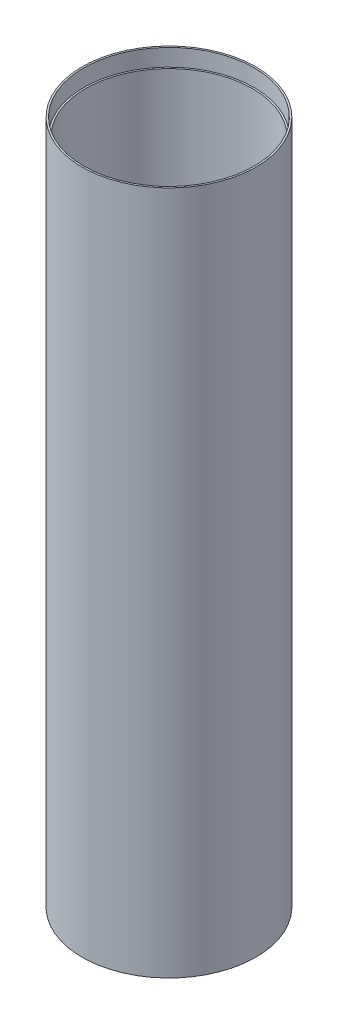
ISO-10303-21;
HEADER;
FILE_DESCRIPTION(('STEP AP214'),'2;1');
FILE_NAME('part.step','',(''),(''),'','','');
FILE_SCHEMA(('AUTOMOTIVE_DESIGN { 1 0 10303 214 1 1 1 1 }'));
ENDSEC;
DATA;
#1=APPLICATION_CONTEXT('core data for automotive mechanical design processes');
#2=APPLICATION_PROTOCOL_DEFINITION('international standard','automotive_design',2000,#1);
#3=PRODUCT_CONTEXT('',#1,'mechanical');
#4=PRODUCT('Part','Part','',(#3));
#5=PRODUCT_RELATED_PRODUCT_CATEGORY('part','',(#4));
#6=PRODUCT_DEFINITION_FORMATION('','',#4);
#7=PRODUCT_DEFINITION_CONTEXT('part definition',#1,'design');
#8=PRODUCT_DEFINITION('design','',#6,#7);
#9=PRODUCT_DEFINITION_SHAPE('','',#8);
#10=(LENGTH_UNIT() NAMED_UNIT(*) SI_UNIT(.MILLI.,.METRE.));
#11=(NAMED_UNIT(*) PLANE_ANGLE_UNIT() SI_UNIT($,.RADIAN.));
#12=(NAMED_UNIT(*) SI_UNIT($,.STERADIAN.) SOLID_ANGLE_UNIT());
#13=UNCERTAINTY_MEASURE_WITH_UNIT(LENGTH_MEASURE(1.E-05),#10,'distance_accuracy_value','');
#14=(GEOMETRIC_REPRESENTATION_CONTEXT(3) GLOBAL_UNCERTAINTY_ASSIGNED_CONTEXT((#13)) GLOBAL_UNIT_ASSIGNED_CONTEXT((#10,
#11,#12)) REPRESENTATION_CONTEXT('',''));
#15=CARTESIAN_POINT('',(0.,0.,0.));
#16=DIRECTION('',(0.,0.,1.));
#17=DIRECTION('',(1.,0.,0.));
#18=AXIS2_PLACEMENT_3D('',#15,#16,#17);
#19=CARTESIAN_POINT('',(124.5,1000.,0.));
#20=DIRECTION('',(0.,1.,0.));
#21=DIRECTION('',(0.,0.,1.));
#22=AXIS2_PLACEMENT_3D('',#19,#20,#21);
#23=PLANE('',#22);
#24=CARTESIAN_POINT('',(0.,1000.,0.));
#25=DIRECTION('',(0.,-1.,0.));
#26=DIRECTION('',(0.,0.,-1.));
#27=AXIS2_PLACEMENT_3D('',#24,#25,#26);
#28=CIRCLE('',#27,124.5);
#29=CARTESIAN_POINT('',(0.,1000.,-124.5));
#30=VERTEX_POINT('',#29);
#31=EDGE_CURVE('E67',#30,#30,#28,.T.);
#32=ORIENTED_EDGE('',*,*,#31,.T.);
#33=EDGE_LOOP('',(#32));
#34=FACE_BOUND('',#33,.T.);
#35=CARTESIAN_POINT('',(0.,1000.,0.));
#36=DIRECTION('',(0.,-1.,0.));
#37=DIRECTION('',(0.,0.,-1.));
#38=AXIS2_PLACEMENT_3D('',#35,#36,#37);
#39=CIRCLE('',#38,127.);
#40=CARTESIAN_POINT('',(0.,1000.,-127.));
#41=VERTEX_POINT('',#40);
#42=EDGE_CURVE('E10',#41,#41,#39,.T.);
#43=ORIENTED_EDGE('',*,*,#42,.F.);
#44=EDGE_LOOP('',(#43));
#45=FACE_BOUND('',#44,.T.);
#46=ADVANCED_FACE('F39',(#34,#45),#23,.T.);
#47=CARTESIAN_POINT('',(0.,0.,0.));
#48=DIRECTION('',(0.,-1.,0.));
#49=DIRECTION('',(0.,0.,-1.));
#50=AXIS2_PLACEMENT_3D('',#47,#48,#49);
#51=CYLINDRICAL_SURFACE('',#50,127.);
#52=ORIENTED_EDGE('',*,*,#42,.T.);
#53=EDGE_LOOP('',(#52));
#54=FACE_BOUND('',#53,.T.);
#55=CARTESIAN_POINT('',(0.,0.,0.));
#56=DIRECTION('',(0.,-1.,0.));
#57=DIRECTION('',(0.,0.,-1.));
#58=AXIS2_PLACEMENT_3D('',#55,#56,#57);
#59=CIRCLE('',#58,127.);
#60=CARTESIAN_POINT('',(0.,0.,-127.));
#61=VERTEX_POINT('',#60);
#62=EDGE_CURVE('E45',#61,#61,#59,.T.);
#63=ORIENTED_EDGE('',*,*,#62,.F.);
#64=EDGE_LOOP('',(#63));
#65=FACE_BOUND('',#64,.T.);
#66=ADVANCED_FACE('F85',(#54,#65),#51,.T.);
#67=CARTESIAN_POINT('',(124.5,0.,0.));
#68=DIRECTION('',(0.,-1.,0.));
#69=DIRECTION('',(0.,0.,-1.));
#70=AXIS2_PLACEMENT_3D('',#67,#68,#69);
#71=PLANE('',#70);
#72=ORIENTED_EDGE('',*,*,#62,.T.);
#73=EDGE_LOOP('',(#72));
#74=FACE_BOUND('',#73,.T.);
#75=CARTESIAN_POINT('',(0.,0.,0.));
#76=DIRECTION('',(0.,-1.,0.));
#77=DIRECTION('',(0.,0.,-1.));
#78=AXIS2_PLACEMENT_3D('',#75,#76,#77);
#79=CIRCLE('',#78,124.5);
#80=CARTESIAN_POINT('',(0.,0.,-124.5));
#81=VERTEX_POINT('',#80);
#82=EDGE_CURVE('E49',#81,#81,#79,.T.);
#83=ORIENTED_EDGE('',*,*,#82,.F.);
#84=EDGE_LOOP('',(#83));
#85=FACE_BOUND('',#84,.T.);
#86=ADVANCED_FACE('F89',(#74,#85),#71,.T.);
#87=CARTESIAN_POINT('',(0.,0.,0.));
#88=DIRECTION('',(0.,-1.,0.));
#89=DIRECTION('',(0.,0.,-1.));
#90=AXIS2_PLACEMENT_3D('',#87,#88,#89);
#91=CYLINDRICAL_SURFACE('',#90,124.5);
#92=ORIENTED_EDGE('',*,*,#82,.T.);
#93=EDGE_LOOP('',(#92));
#94=FACE_BOUND('',#93,.T.);
#95=CARTESIAN_POINT('',(0.,25.,0.));
#96=DIRECTION('',(0.,-1.,0.));
#97=DIRECTION('',(0.,0.,-1.));
#98=AXIS2_PLACEMENT_3D('',#95,#96,#97);
#99=CIRCLE('',#98,124.5);
#100=CARTESIAN_POINT('',(0.,25.,-124.5));
#101=VERTEX_POINT('',#100);
#102=EDGE_CURVE('E53',#101,#101,#99,.T.);
#103=ORIENTED_EDGE('',*,*,#102,.F.);
#104=EDGE_LOOP('',(#103));
#105=FACE_BOUND('',#104,.T.);
#106=ADVANCED_FACE('F93',(#94,#105),#91,.F.);
#107=CARTESIAN_POINT('',(122.,25.,0.));
#108=DIRECTION('',(0.,-1.,0.));
#109=DIRECTION('',(0.,0.,-1.));
#110=AXIS2_PLACEMENT_3D('',#107,#108,#109);
#111=PLANE('',#110);
#112=ORIENTED_EDGE('',*,*,#102,.T.);
#113=EDGE_LOOP('',(#112));
#114=FACE_BOUND('',#113,.T.);
#115=CARTESIAN_POINT('',(0.,25.,0.));
#116=DIRECTION('',(0.,-1.,0.));
#117=DIRECTION('',(0.,0.,-1.));
#118=AXIS2_PLACEMENT_3D('',#115,#116,#117);
#119=CIRCLE('',#118,122.);
#120=CARTESIAN_POINT('',(0.,25.,-122.));
#121=VERTEX_POINT('',#120);
#122=EDGE_CURVE('E58',#121,#121,#119,.T.);
#123=ORIENTED_EDGE('',*,*,#122,.F.);
#124=EDGE_LOOP('',(#123));
#125=FACE_BOUND('',#124,.T.);
#126=ADVANCED_FACE('F99',(#114,#125),#111,.T.);
#127=CARTESIAN_POINT('',(0.,0.,0.));
#128=DIRECTION('',(0.,-1.,0.));
#129=DIRECTION('',(0.,0.,-1.));
#130=AXIS2_PLACEMENT_3D('',#127,#128,#129);
#131=CYLINDRICAL_SURFACE('',#130,122.);
#132=ORIENTED_EDGE('',*,*,#122,.T.);
#133=EDGE_LOOP('',(#132));
#134=FACE_BOUND('',#133,.T.);
#135=CARTESIAN_POINT('',(0.,975.,0.));
#136=DIRECTION('',(0.,-1.,0.));
#137=DIRECTION('',(0.,0.,-1.));
#138=AXIS2_PLACEMENT_3D('',#135,#136,#137);
#139=CIRCLE('',#138,122.);
#140=CARTESIAN_POINT('',(0.,975.,-122.));
#141=VERTEX_POINT('',#140);
#142=EDGE_CURVE('E61',#141,#141,#139,.T.);
#143=ORIENTED_EDGE('',*,*,#142,.F.);
#144=EDGE_LOOP('',(#143));
#145=FACE_BOUND('',#144,.T.);
#146=ADVANCED_FACE('F81',(#134,#145),#131,.F.);
#147=CARTESIAN_POINT('',(122.,975.,0.));
#148=DIRECTION('',(0.,1.,0.));
#149=DIRECTION('',(0.,0.,1.));
#150=AXIS2_PLACEMENT_3D('',#147,#148,#149);
#151=PLANE('',#150);
#152=ORIENTED_EDGE('',*,*,#142,.T.);
#153=EDGE_LOOP('',(#152));
#154=FACE_BOUND('',#153,.T.);
#155=CARTESIAN_POINT('',(0.,975.,0.));
#156=DIRECTION('',(0.,-1.,0.));
#157=DIRECTION('',(0.,0.,-1.));
#158=AXIS2_PLACEMENT_3D('',#155,#156,#157);
#159=CIRCLE('',#158,124.5);
#160=CARTESIAN_POINT('',(0.,975.,-124.5));
#161=VERTEX_POINT('',#160);
#162=EDGE_CURVE('E64',#161,#161,#159,.T.);
#163=ORIENTED_EDGE('',*,*,#162,.F.);
#164=EDGE_LOOP('',(#163));
#165=FACE_BOUND('',#164,.T.);
#166=ADVANCED_FACE('F75',(#154,#165),#151,.T.);
#167=CARTESIAN_POINT('',(0.,0.,0.));
#168=DIRECTION('',(0.,-1.,0.));
#169=DIRECTION('',(0.,0.,-1.));
#170=AXIS2_PLACEMENT_3D('',#167,#168,#169);
#171=CYLINDRICAL_SURFACE('',#170,124.5);
#172=ORIENTED_EDGE('',*,*,#162,.T.);
#173=EDGE_LOOP('',(#172));
#174=FACE_BOUND('',#173,.T.);
#175=ORIENTED_EDGE('',*,*,#31,.F.);
#176=EDGE_LOOP('',(#175));
#177=FACE_BOUND('',#176,.T.);
#178=ADVANCED_FACE('F73',(#174,#177),#171,.F.);
#179=CLOSED_SHELL('',(#46,#66,#86,#106,#126,#146,#166,#178));
#180=MANIFOLD_SOLID_BREP('B2',#179);
#181=ADVANCED_BREP_SHAPE_REPRESENTATION('',(#18,#180),#14);
#182=SHAPE_DEFINITION_REPRESENTATION(#9,#181);
ENDSEC;
END-ISO-10303-21;
